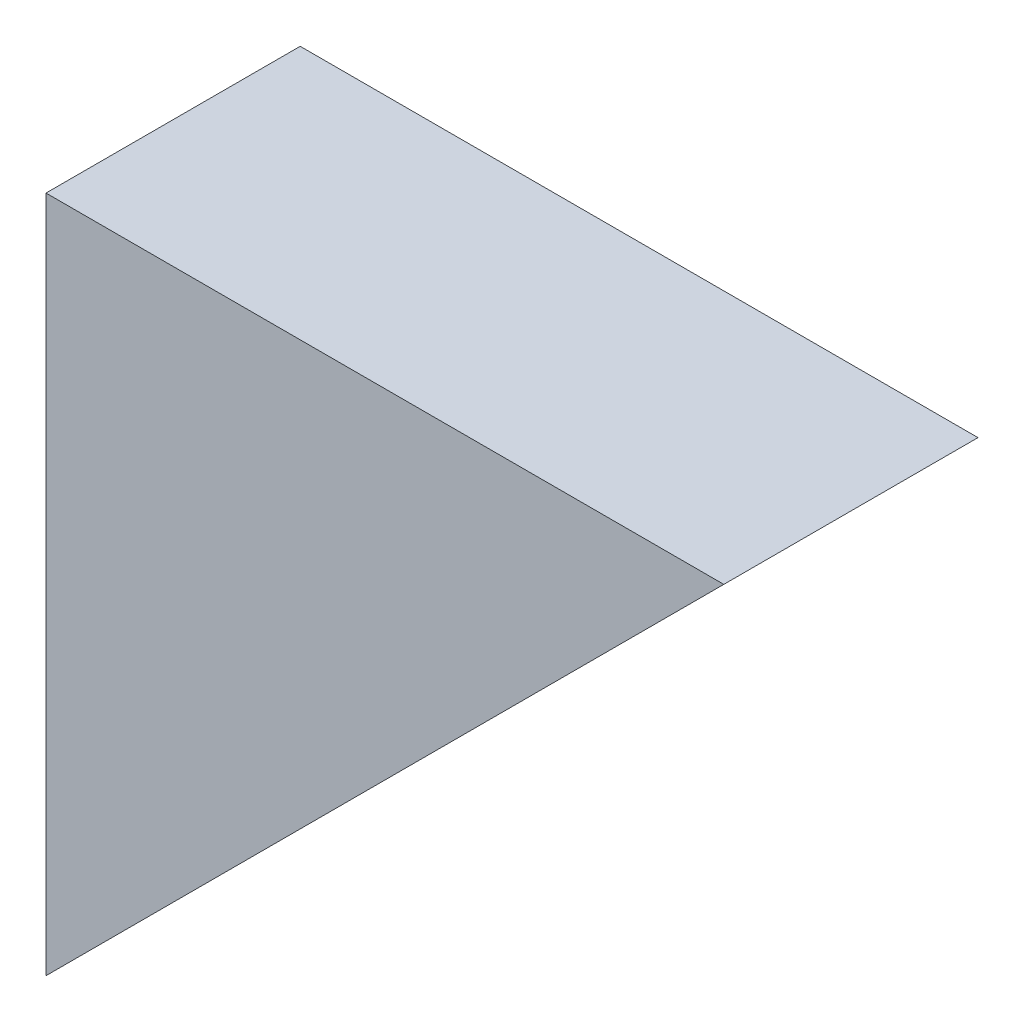
ISO-10303-21;
HEADER;
FILE_DESCRIPTION(('STEP AP214'),'2;1');
FILE_NAME('part.step','',(''),(''),'','','');
FILE_SCHEMA(('AUTOMOTIVE_DESIGN { 1 0 10303 214 1 1 1 1 }'));
ENDSEC;
DATA;
#1=APPLICATION_CONTEXT('core data for automotive mechanical design processes');
#2=APPLICATION_PROTOCOL_DEFINITION('international standard','automotive_design',2000,#1);
#3=PRODUCT_CONTEXT('',#1,'mechanical');
#4=PRODUCT('Part','Part','',(#3));
#5=PRODUCT_RELATED_PRODUCT_CATEGORY('part','',(#4));
#6=PRODUCT_DEFINITION_FORMATION('','',#4);
#7=PRODUCT_DEFINITION_CONTEXT('part definition',#1,'design');
#8=PRODUCT_DEFINITION('design','',#6,#7);
#9=PRODUCT_DEFINITION_SHAPE('','',#8);
#10=(LENGTH_UNIT() NAMED_UNIT(*) SI_UNIT(.MILLI.,.METRE.));
#11=(NAMED_UNIT(*) PLANE_ANGLE_UNIT() SI_UNIT($,.RADIAN.));
#12=(NAMED_UNIT(*) SI_UNIT($,.STERADIAN.) SOLID_ANGLE_UNIT());
#13=UNCERTAINTY_MEASURE_WITH_UNIT(LENGTH_MEASURE(1.E-05),#10,'distance_accuracy_value','');
#14=(GEOMETRIC_REPRESENTATION_CONTEXT(3) GLOBAL_UNCERTAINTY_ASSIGNED_CONTEXT((#13)) GLOBAL_UNIT_ASSIGNED_CONTEXT((#10,
#11,#12)) REPRESENTATION_CONTEXT('',''));
#15=CARTESIAN_POINT('',(0.,0.,0.));
#16=DIRECTION('',(0.,0.,1.));
#17=DIRECTION('',(1.,0.,0.));
#18=AXIS2_PLACEMENT_3D('',#15,#16,#17);
#19=CARTESIAN_POINT('',(0.,101.6,-19.05));
#20=DIRECTION('',(-1.,0.,0.));
#21=DIRECTION('',(0.,0.,1.));
#22=AXIS2_PLACEMENT_3D('',#19,#20,#21);
#23=PLANE('',#22);
#24=DIRECTION('',(0.,0.,1.));
#25=VECTOR('',#24,1.);
#26=CARTESIAN_POINT('',(0.,0.,-19.05));
#27=LINE('',#26,#25);
#28=CARTESIAN_POINT('',(0.,0.,-19.05));
#29=VERTEX_POINT('',#28);
#30=CARTESIAN_POINT('',(0.,0.,19.05));
#31=VERTEX_POINT('',#30);
#32=EDGE_CURVE('E35',#29,#31,#27,.T.);
#33=ORIENTED_EDGE('',*,*,#32,.T.);
#34=DIRECTION('',(0.,-1.,0.));
#35=VECTOR('',#34,1.);
#36=CARTESIAN_POINT('',(0.,101.6,19.05));
#37=LINE('',#36,#35);
#38=CARTESIAN_POINT('',(0.,101.6,19.05));
#39=VERTEX_POINT('',#38);
#40=EDGE_CURVE('E66',#39,#31,#37,.T.);
#41=ORIENTED_EDGE('',*,*,#40,.F.);
#42=DIRECTION('',(0.,0.,1.));
#43=VECTOR('',#42,1.);
#44=CARTESIAN_POINT('',(0.,101.6,-19.05));
#45=LINE('',#44,#43);
#46=CARTESIAN_POINT('',(0.,101.6,-19.05));
#47=VERTEX_POINT('',#46);
#48=EDGE_CURVE('E11',#47,#39,#45,.T.);
#49=ORIENTED_EDGE('',*,*,#48,.F.);
#50=DIRECTION('',(0.,-1.,0.));
#51=VECTOR('',#50,1.);
#52=CARTESIAN_POINT('',(0.,101.6,-19.05));
#53=LINE('',#52,#51);
#54=EDGE_CURVE('E67',#47,#29,#53,.T.);
#55=ORIENTED_EDGE('',*,*,#54,.T.);
#56=EDGE_LOOP('',(#33,#41,#49,#55));
#57=FACE_BOUND('',#56,.T.);
#58=ADVANCED_FACE('F32',(#57),#23,.T.);
#59=CARTESIAN_POINT('',(101.6,101.6,-19.05));
#60=DIRECTION('',(0.,1.,0.));
#61=DIRECTION('',(0.,0.,1.));
#62=AXIS2_PLACEMENT_3D('',#59,#60,#61);
#63=PLANE('',#62);
#64=ORIENTED_EDGE('',*,*,#48,.T.);
#65=DIRECTION('',(-1.,0.,0.));
#66=VECTOR('',#65,1.);
#67=CARTESIAN_POINT('',(101.6,101.6,19.05));
#68=LINE('',#67,#66);
#69=CARTESIAN_POINT('',(101.6,101.6,19.05));
#70=VERTEX_POINT('',#69);
#71=EDGE_CURVE('E76',#70,#39,#68,.T.);
#72=ORIENTED_EDGE('',*,*,#71,.F.);
#73=DIRECTION('',(0.,0.,1.));
#74=VECTOR('',#73,1.);
#75=CARTESIAN_POINT('',(101.6,101.6,-19.05));
#76=LINE('',#75,#74);
#77=CARTESIAN_POINT('',(101.6,101.6,-19.05));
#78=VERTEX_POINT('',#77);
#79=EDGE_CURVE('E40',#78,#70,#76,.T.);
#80=ORIENTED_EDGE('',*,*,#79,.F.);
#81=DIRECTION('',(-1.,0.,0.));
#82=VECTOR('',#81,1.);
#83=CARTESIAN_POINT('',(101.6,101.6,-19.05));
#84=LINE('',#83,#82);
#85=EDGE_CURVE('E70',#78,#47,#84,.T.);
#86=ORIENTED_EDGE('',*,*,#85,.T.);
#87=EDGE_LOOP('',(#64,#72,#80,#86));
#88=FACE_BOUND('',#87,.T.);
#89=ADVANCED_FACE('F86',(#88),#63,.T.);
#90=CARTESIAN_POINT('',(0.,0.,-19.05));
#91=DIRECTION('',(0.707106781186549,-0.707106781186546,0.));
#92=DIRECTION('',(0.707106781186546,0.707106781186549,0.));
#93=AXIS2_PLACEMENT_3D('',#90,#91,#92);
#94=PLANE('',#93);
#95=ORIENTED_EDGE('',*,*,#79,.T.);
#96=DIRECTION('',(0.707106781186546,0.707106781186549,0.));
#97=VECTOR('',#96,1.);
#98=CARTESIAN_POINT('',(0.,0.,19.05));
#99=LINE('',#98,#97);
#100=EDGE_CURVE('E72',#31,#70,#99,.T.);
#101=ORIENTED_EDGE('',*,*,#100,.F.);
#102=ORIENTED_EDGE('',*,*,#32,.F.);
#103=DIRECTION('',(0.707106781186546,0.707106781186549,0.));
#104=VECTOR('',#103,1.);
#105=CARTESIAN_POINT('',(0.,0.,-19.05));
#106=LINE('',#105,#104);
#107=EDGE_CURVE('E83',#29,#78,#106,.T.);
#108=ORIENTED_EDGE('',*,*,#107,.T.);
#109=EDGE_LOOP('',(#95,#101,#102,#108));
#110=FACE_BOUND('',#109,.T.);
#111=ADVANCED_FACE('F73',(#110),#94,.T.);
#112=CARTESIAN_POINT('',(0.,0.,-19.05));
#113=DIRECTION('',(0.,0.,-1.));
#114=DIRECTION('',(-1.,0.,0.));
#115=AXIS2_PLACEMENT_3D('',#112,#113,#114);
#116=PLANE('',#115);
#117=ORIENTED_EDGE('',*,*,#54,.F.);
#118=ORIENTED_EDGE('',*,*,#85,.F.);
#119=ORIENTED_EDGE('',*,*,#107,.F.);
#120=EDGE_LOOP('',(#117,#118,#119));
#121=FACE_BOUND('',#120,.T.);
#122=ADVANCED_FACE('F88',(#121),#116,.T.);
#123=CARTESIAN_POINT('',(0.,0.,19.05));
#124=DIRECTION('',(0.,0.,-1.));
#125=DIRECTION('',(-1.,0.,0.));
#126=AXIS2_PLACEMENT_3D('',#123,#124,#125);
#127=PLANE('',#126);
#128=ORIENTED_EDGE('',*,*,#40,.T.);
#129=ORIENTED_EDGE('',*,*,#100,.T.);
#130=ORIENTED_EDGE('',*,*,#71,.T.);
#131=EDGE_LOOP('',(#128,#129,#130));
#132=FACE_BOUND('',#131,.T.);
#133=ADVANCED_FACE('F78',(#132),#127,.F.);
#134=CLOSED_SHELL('',(#58,#89,#111,#122,#133));
#135=MANIFOLD_SOLID_BREP('B2',#134);
#136=ADVANCED_BREP_SHAPE_REPRESENTATION('',(#18,#135),#14);
#137=SHAPE_DEFINITION_REPRESENTATION(#9,#136);
ENDSEC;
END-ISO-10303-21;
